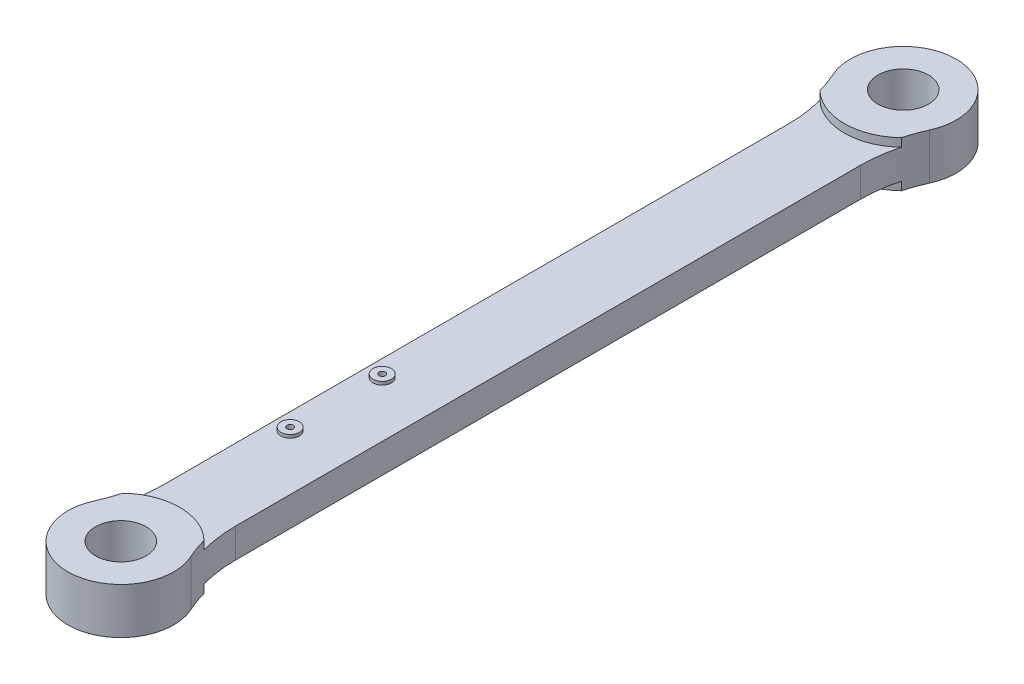
ISO-10303-21;
HEADER;
FILE_DESCRIPTION(('STEP AP214'),'2;1');
FILE_NAME('part.step','',(''),(''),'','','');
FILE_SCHEMA(('AUTOMOTIVE_DESIGN { 1 0 10303 214 1 1 1 1 }'));
ENDSEC;
DATA;
#1=APPLICATION_CONTEXT('core data for automotive mechanical design processes');
#2=APPLICATION_PROTOCOL_DEFINITION('international standard','automotive_design',2000,#1);
#3=PRODUCT_CONTEXT('',#1,'mechanical');
#4=PRODUCT('Part','Part','',(#3));
#5=PRODUCT_RELATED_PRODUCT_CATEGORY('part','',(#4));
#6=PRODUCT_DEFINITION_FORMATION('','',#4);
#7=PRODUCT_DEFINITION_CONTEXT('part definition',#1,'design');
#8=PRODUCT_DEFINITION('design','',#6,#7);
#9=PRODUCT_DEFINITION_SHAPE('','',#8);
#10=(LENGTH_UNIT() NAMED_UNIT(*) SI_UNIT(.MILLI.,.METRE.));
#11=(NAMED_UNIT(*) PLANE_ANGLE_UNIT() SI_UNIT($,.RADIAN.));
#12=(NAMED_UNIT(*) SI_UNIT($,.STERADIAN.) SOLID_ANGLE_UNIT());
#13=UNCERTAINTY_MEASURE_WITH_UNIT(LENGTH_MEASURE(1.E-05),#10,'distance_accuracy_value','');
#14=(GEOMETRIC_REPRESENTATION_CONTEXT(3) GLOBAL_UNCERTAINTY_ASSIGNED_CONTEXT((#13)) GLOBAL_UNIT_ASSIGNED_CONTEXT((#10,
#11,#12)) REPRESENTATION_CONTEXT('',''));
#15=CARTESIAN_POINT('',(0.,0.,0.));
#16=DIRECTION('',(0.,0.,1.));
#17=DIRECTION('',(1.,0.,0.));
#18=AXIS2_PLACEMENT_3D('',#15,#16,#17);
#19=CARTESIAN_POINT('',(0.,50.,0.));
#20=DIRECTION('',(0.,1.,0.));
#21=DIRECTION('',(0.,0.,1.));
#22=AXIS2_PLACEMENT_3D('',#19,#20,#21);
#23=PLANE('',#22);
#24=CARTESIAN_POINT('',(0.,50.,0.));
#25=DIRECTION('',(0.,1.,0.));
#26=DIRECTION('',(0.,0.,1.));
#27=AXIS2_PLACEMENT_3D('',#24,#25,#26);
#28=CIRCLE('',#27,115.);
#29=CARTESIAN_POINT('',(104.746987951807,50.,47.466498870508));
#30=VERTEX_POINT('',#29);
#31=CARTESIAN_POINT('',(-104.746987951807,50.,47.4664988705083));
#32=VERTEX_POINT('',#31);
#33=EDGE_CURVE('E247',#30,#32,#28,.T.);
#34=ORIENTED_EDGE('',*,*,#33,.T.);
#35=CARTESIAN_POINT('',(-378.,50.,171.292148097921));
#36=DIRECTION('',(0.,1.,0.));
#37=DIRECTION('',(0.,0.,1.));
#38=AXIS2_PLACEMENT_3D('',#35,#36,#37);
#39=CIRCLE('',#38,300.);
#40=CARTESIAN_POINT('',(-88.5520770167693,50.,92.4258062232414));
#41=VERTEX_POINT('',#40);
#42=EDGE_CURVE('E245',#32,#41,#39,.F.);
#43=ORIENTED_EDGE('',*,*,#42,.T.);
#44=CARTESIAN_POINT('',(0.,50.,0.));
#45=DIRECTION('',(0.,1.,0.));
#46=DIRECTION('',(0.,0.,1.));
#47=AXIS2_PLACEMENT_3D('',#44,#45,#46);
#48=CIRCLE('',#47,128.);
#49=CARTESIAN_POINT('',(88.5520770167693,50.,92.4258062232414));
#50=VERTEX_POINT('',#49);
#51=EDGE_CURVE('E240',#50,#41,#48,.F.);
#52=ORIENTED_EDGE('',*,*,#51,.F.);
#53=CARTESIAN_POINT('',(378.,50.,171.292148097921));
#54=DIRECTION('',(0.,1.,0.));
#55=DIRECTION('',(0.,0.,1.));
#56=AXIS2_PLACEMENT_3D('',#53,#54,#55);
#57=CIRCLE('',#56,300.);
#58=EDGE_CURVE('E243',#50,#30,#57,.F.);
#59=ORIENTED_EDGE('',*,*,#58,.T.);
#60=EDGE_LOOP('',(#34,#43,#52,#59));
#61=FACE_BOUND('',#60,.T.);
#62=CARTESIAN_POINT('',(0.,50.,0.));
#63=DIRECTION('',(0.,1.,0.));
#64=DIRECTION('',(0.,0.,1.));
#65=AXIS2_PLACEMENT_3D('',#62,#63,#64);
#66=CIRCLE('',#65,55.);
#67=CARTESIAN_POINT('',(0.,50.,55.));
#68=VERTEX_POINT('',#67);
#69=EDGE_CURVE('E187',#68,#68,#66,.T.);
#70=ORIENTED_EDGE('',*,*,#69,.F.);
#71=EDGE_LOOP('',(#70));
#72=FACE_BOUND('',#71,.T.);
#73=ADVANCED_FACE('F18',(#61,#72),#23,.T.);
#74=CARTESIAN_POINT('',(0.,-50.,0.));
#75=DIRECTION('',(0.,-1.,0.));
#76=DIRECTION('',(0.,0.,-1.));
#77=AXIS2_PLACEMENT_3D('',#74,#75,#76);
#78=PLANE('',#77);
#79=CARTESIAN_POINT('',(0.,-50.,0.));
#80=DIRECTION('',(0.,-1.,0.));
#81=DIRECTION('',(0.,0.,-1.));
#82=AXIS2_PLACEMENT_3D('',#79,#80,#81);
#83=CIRCLE('',#82,115.);
#84=CARTESIAN_POINT('',(-104.746987951807,-50.,47.4664988705082));
#85=VERTEX_POINT('',#84);
#86=CARTESIAN_POINT('',(104.746987951807,-50.,47.466498870508));
#87=VERTEX_POINT('',#86);
#88=EDGE_CURVE('E233',#85,#87,#83,.T.);
#89=ORIENTED_EDGE('',*,*,#88,.T.);
#90=CARTESIAN_POINT('',(378.,-50.,171.292148097921));
#91=DIRECTION('',(0.,-1.,0.));
#92=DIRECTION('',(0.,0.,-1.));
#93=AXIS2_PLACEMENT_3D('',#90,#91,#92);
#94=CIRCLE('',#93,300.);
#95=CARTESIAN_POINT('',(88.5520770167694,-50.,92.4258062232414));
#96=VERTEX_POINT('',#95);
#97=EDGE_CURVE('E33',#87,#96,#94,.F.);
#98=ORIENTED_EDGE('',*,*,#97,.T.);
#99=CARTESIAN_POINT('',(0.,-50.,0.));
#100=DIRECTION('',(0.,-1.,0.));
#101=DIRECTION('',(0.,0.,-1.));
#102=AXIS2_PLACEMENT_3D('',#99,#100,#101);
#103=CIRCLE('',#102,128.);
#104=CARTESIAN_POINT('',(-88.5520770167692,-50.,92.4258062232415));
#105=VERTEX_POINT('',#104);
#106=EDGE_CURVE('E228',#105,#96,#103,.F.);
#107=ORIENTED_EDGE('',*,*,#106,.F.);
#108=CARTESIAN_POINT('',(-378.,-50.,171.292148097921));
#109=DIRECTION('',(0.,-1.,0.));
#110=DIRECTION('',(0.,0.,-1.));
#111=AXIS2_PLACEMENT_3D('',#108,#109,#110);
#112=CIRCLE('',#111,300.);
#113=EDGE_CURVE('E231',#105,#85,#112,.F.);
#114=ORIENTED_EDGE('',*,*,#113,.T.);
#115=EDGE_LOOP('',(#89,#98,#107,#114));
#116=FACE_BOUND('',#115,.T.);
#117=CARTESIAN_POINT('',(0.,-50.,0.));
#118=DIRECTION('',(0.,-1.,0.));
#119=DIRECTION('',(0.,0.,-1.));
#120=AXIS2_PLACEMENT_3D('',#117,#118,#119);
#121=CIRCLE('',#120,55.);
#122=CARTESIAN_POINT('',(0.,-50.,-55.));
#123=VERTEX_POINT('',#122);
#124=EDGE_CURVE('E181',#123,#123,#121,.T.);
#125=ORIENTED_EDGE('',*,*,#124,.F.);
#126=EDGE_LOOP('',(#125));
#127=FACE_BOUND('',#126,.T.);
#128=ADVANCED_FACE('F153',(#116,#127),#78,.T.);
#129=CARTESIAN_POINT('',(0.,50.,1700.));
#130=DIRECTION('',(0.,1.,0.));
#131=DIRECTION('',(0.,0.,1.));
#132=AXIS2_PLACEMENT_3D('',#129,#130,#131);
#133=CIRCLE('',#132,115.);
#134=CARTESIAN_POINT('',(-104.746987951807,50.,1652.53350112949));
#135=VERTEX_POINT('',#134);
#136=CARTESIAN_POINT('',(104.746987951807,50.,1652.53350112949));
#137=VERTEX_POINT('',#136);
#138=EDGE_CURVE('E174',#135,#137,#133,.T.);
#139=ORIENTED_EDGE('',*,*,#138,.T.);
#140=CARTESIAN_POINT('',(378.,50.,1528.70785190208));
#141=DIRECTION('',(0.,1.,0.));
#142=DIRECTION('',(0.,0.,1.));
#143=AXIS2_PLACEMENT_3D('',#140,#141,#142);
#144=CIRCLE('',#143,300.);
#145=CARTESIAN_POINT('',(88.5520770167694,50.,1607.57419377676));
#146=VERTEX_POINT('',#145);
#147=EDGE_CURVE('E235',#137,#146,#144,.F.);
#148=ORIENTED_EDGE('',*,*,#147,.T.);
#149=CARTESIAN_POINT('',(0.,50.,1700.));
#150=DIRECTION('',(0.,1.,0.));
#151=DIRECTION('',(0.,0.,1.));
#152=AXIS2_PLACEMENT_3D('',#149,#150,#151);
#153=CIRCLE('',#152,128.);
#154=CARTESIAN_POINT('',(-88.5520770167694,50.,1607.57419377676));
#155=VERTEX_POINT('',#154);
#156=EDGE_CURVE('E26',#146,#155,#153,.T.);
#157=ORIENTED_EDGE('',*,*,#156,.T.);
#158=CARTESIAN_POINT('',(-378.,50.,1528.70785190208));
#159=DIRECTION('',(0.,1.,0.));
#160=DIRECTION('',(0.,0.,1.));
#161=AXIS2_PLACEMENT_3D('',#158,#159,#160);
#162=CIRCLE('',#161,300.);
#163=EDGE_CURVE('E237',#155,#135,#162,.F.);
#164=ORIENTED_EDGE('',*,*,#163,.T.);
#165=EDGE_LOOP('',(#139,#148,#157,#164));
#166=FACE_BOUND('',#165,.T.);
#167=CARTESIAN_POINT('',(0.,50.,1700.));
#168=DIRECTION('',(0.,1.,0.));
#169=DIRECTION('',(0.,0.,1.));
#170=AXIS2_PLACEMENT_3D('',#167,#168,#169);
#171=CIRCLE('',#170,55.);
#172=CARTESIAN_POINT('',(0.,50.,1755.));
#173=VERTEX_POINT('',#172);
#174=EDGE_CURVE('E178',#173,#173,#171,.T.);
#175=ORIENTED_EDGE('',*,*,#174,.F.);
#176=EDGE_LOOP('',(#175));
#177=FACE_BOUND('',#176,.T.);
#178=ADVANCED_FACE('F156',(#166,#177),#23,.T.);
#179=CARTESIAN_POINT('',(0.,-50.,1700.));
#180=DIRECTION('',(0.,-1.,0.));
#181=DIRECTION('',(0.,0.,-1.));
#182=AXIS2_PLACEMENT_3D('',#179,#180,#181);
#183=CIRCLE('',#182,115.);
#184=CARTESIAN_POINT('',(104.746987951807,-50.,1652.53350112949));
#185=VERTEX_POINT('',#184);
#186=CARTESIAN_POINT('',(-104.746987951807,-50.,1652.53350112949));
#187=VERTEX_POINT('',#186);
#188=EDGE_CURVE('E226',#185,#187,#183,.T.);
#189=ORIENTED_EDGE('',*,*,#188,.T.);
#190=CARTESIAN_POINT('',(-378.,-50.,1528.70785190208));
#191=DIRECTION('',(0.,-1.,0.));
#192=DIRECTION('',(0.,0.,-1.));
#193=AXIS2_PLACEMENT_3D('',#190,#191,#192);
#194=CIRCLE('',#193,300.);
#195=CARTESIAN_POINT('',(-88.5520770167694,-50.,1607.57419377676));
#196=VERTEX_POINT('',#195);
#197=EDGE_CURVE('E40',#187,#196,#194,.F.);
#198=ORIENTED_EDGE('',*,*,#197,.T.);
#199=CARTESIAN_POINT('',(0.,-50.,1700.));
#200=DIRECTION('',(0.,-1.,0.));
#201=DIRECTION('',(0.,0.,-1.));
#202=AXIS2_PLACEMENT_3D('',#199,#200,#201);
#203=CIRCLE('',#202,128.);
#204=CARTESIAN_POINT('',(88.5520770167694,-50.,1607.57419377676));
#205=VERTEX_POINT('',#204);
#206=EDGE_CURVE('E11',#196,#205,#203,.T.);
#207=ORIENTED_EDGE('',*,*,#206,.T.);
#208=CARTESIAN_POINT('',(378.,-50.,1528.70785190208));
#209=DIRECTION('',(0.,-1.,0.));
#210=DIRECTION('',(0.,0.,-1.));
#211=AXIS2_PLACEMENT_3D('',#208,#209,#210);
#212=CIRCLE('',#211,300.);
#213=EDGE_CURVE('E220',#205,#185,#212,.F.);
#214=ORIENTED_EDGE('',*,*,#213,.T.);
#215=EDGE_LOOP('',(#189,#198,#207,#214));
#216=FACE_BOUND('',#215,.T.);
#217=CARTESIAN_POINT('',(0.,-50.,1700.));
#218=DIRECTION('',(0.,-1.,0.));
#219=DIRECTION('',(0.,0.,-1.));
#220=AXIS2_PLACEMENT_3D('',#217,#218,#219);
#221=CIRCLE('',#220,55.);
#222=CARTESIAN_POINT('',(0.,-50.,1645.));
#223=VERTEX_POINT('',#222);
#224=EDGE_CURVE('E180',#223,#223,#221,.T.);
#225=ORIENTED_EDGE('',*,*,#224,.F.);
#226=EDGE_LOOP('',(#225));
#227=FACE_BOUND('',#226,.T.);
#228=ADVANCED_FACE('F161',(#216,#227),#78,.T.);
#229=CARTESIAN_POINT('',(0.,-32.,0.));
#230=DIRECTION('',(0.,1.,0.));
#231=DIRECTION('',(0.,0.,1.));
#232=AXIS2_PLACEMENT_3D('',#229,#230,#231);
#233=CYLINDRICAL_SURFACE('',#232,115.);
#234=ORIENTED_EDGE('',*,*,#88,.F.);
#235=DIRECTION('',(0.,1.,0.));
#236=VECTOR('',#235,1.);
#237=CARTESIAN_POINT('',(-104.746987951807,-32.,47.4664988705083));
#238=LINE('',#237,#236);
#239=EDGE_CURVE('E299',#85,#32,#238,.T.);
#240=ORIENTED_EDGE('',*,*,#239,.T.);
#241=ORIENTED_EDGE('',*,*,#33,.F.);
#242=DIRECTION('',(0.,1.,0.));
#243=VECTOR('',#242,1.);
#244=CARTESIAN_POINT('',(104.746987951807,-32.,47.4664988705081));
#245=LINE('',#244,#243);
#246=EDGE_CURVE('E308',#30,#87,#245,.F.);
#247=ORIENTED_EDGE('',*,*,#246,.T.);
#248=EDGE_LOOP('',(#234,#240,#241,#247));
#249=FACE_BOUND('',#248,.T.);
#250=ADVANCED_FACE('F170',(#249),#233,.T.);
#251=CARTESIAN_POINT('',(0.,-32.,1700.));
#252=DIRECTION('',(0.,1.,0.));
#253=DIRECTION('',(0.,0.,1.));
#254=AXIS2_PLACEMENT_3D('',#251,#252,#253);
#255=CYLINDRICAL_SURFACE('',#254,115.);
#256=ORIENTED_EDGE('',*,*,#188,.F.);
#257=DIRECTION('',(0.,1.,0.));
#258=VECTOR('',#257,1.);
#259=CARTESIAN_POINT('',(104.746987951807,-32.,1652.53350112949));
#260=LINE('',#259,#258);
#261=EDGE_CURVE('E341',#185,#137,#260,.T.);
#262=ORIENTED_EDGE('',*,*,#261,.T.);
#263=ORIENTED_EDGE('',*,*,#138,.F.);
#264=DIRECTION('',(0.,1.,0.));
#265=VECTOR('',#264,1.);
#266=CARTESIAN_POINT('',(-104.746987951807,-32.,1652.53350112949));
#267=LINE('',#266,#265);
#268=EDGE_CURVE('E326',#135,#187,#267,.F.);
#269=ORIENTED_EDGE('',*,*,#268,.T.);
#270=EDGE_LOOP('',(#256,#262,#263,#269));
#271=FACE_BOUND('',#270,.T.);
#272=ADVANCED_FACE('F410',(#271),#255,.T.);
#273=CARTESIAN_POINT('',(-378.,-32.,171.292148097921));
#274=DIRECTION('',(0.,1.,0.));
#275=DIRECTION('',(0.,0.,1.));
#276=AXIS2_PLACEMENT_3D('',#273,#274,#275);
#277=CYLINDRICAL_SURFACE('',#276,300.);
#278=ORIENTED_EDGE('',*,*,#113,.F.);
#279=DIRECTION('',(0.,1.,0.));
#280=VECTOR('',#279,1.);
#281=CARTESIAN_POINT('',(-88.5520770167693,-1978.76654994891,92.4258062232415));
#282=LINE('',#281,#280);
#283=CARTESIAN_POINT('',(-88.5520770167692,-32.,92.4258062232415));
#284=VERTEX_POINT('',#283);
#285=EDGE_CURVE('E259',#105,#284,#282,.T.);
#286=ORIENTED_EDGE('',*,*,#285,.T.);
#287=CARTESIAN_POINT('',(-378.,-32.,171.292148097921));
#288=DIRECTION('',(0.,-1.,0.));
#289=DIRECTION('',(0.,0.,-1.));
#290=AXIS2_PLACEMENT_3D('',#287,#288,#289);
#291=CIRCLE('',#290,300.);
#292=CARTESIAN_POINT('',(-78.,-32.,171.292148097921));
#293=VERTEX_POINT('',#292);
#294=EDGE_CURVE('E288',#293,#284,#291,.F.);
#295=ORIENTED_EDGE('',*,*,#294,.F.);
#296=DIRECTION('',(0.,-1.,0.));
#297=VECTOR('',#296,1.);
#298=CARTESIAN_POINT('',(-78.,-32.,171.292148097921));
#299=LINE('',#298,#297);
#300=CARTESIAN_POINT('',(-78.,32.,171.292148097921));
#301=VERTEX_POINT('',#300);
#302=EDGE_CURVE('E367',#301,#293,#299,.T.);
#303=ORIENTED_EDGE('',*,*,#302,.F.);
#304=CARTESIAN_POINT('',(-378.,32.,171.292148097921));
#305=DIRECTION('',(0.,-1.,0.));
#306=DIRECTION('',(0.,0.,-1.));
#307=AXIS2_PLACEMENT_3D('',#304,#305,#306);
#308=CIRCLE('',#307,300.);
#309=CARTESIAN_POINT('',(-88.5520770167693,32.,92.4258062232413));
#310=VERTEX_POINT('',#309);
#311=EDGE_CURVE('E371',#310,#301,#308,.T.);
#312=ORIENTED_EDGE('',*,*,#311,.F.);
#313=DIRECTION('',(0.,-1.,0.));
#314=VECTOR('',#313,1.);
#315=CARTESIAN_POINT('',(-88.5520770167693,1978.76654994891,92.4258062232414));
#316=LINE('',#315,#314);
#317=EDGE_CURVE('E273',#41,#310,#316,.T.);
#318=ORIENTED_EDGE('',*,*,#317,.F.);
#319=ORIENTED_EDGE('',*,*,#42,.F.);
#320=ORIENTED_EDGE('',*,*,#239,.F.);
#321=EDGE_LOOP('',(#278,#286,#295,#303,#312,#318,#319,#320));
#322=FACE_BOUND('',#321,.T.);
#323=ADVANCED_FACE('F373',(#322),#277,.F.);
#324=CARTESIAN_POINT('',(-378.,-32.,1528.70785190208));
#325=DIRECTION('',(0.,1.,0.));
#326=DIRECTION('',(0.,0.,1.));
#327=AXIS2_PLACEMENT_3D('',#324,#325,#326);
#328=CYLINDRICAL_SURFACE('',#327,300.);
#329=ORIENTED_EDGE('',*,*,#197,.F.);
#330=ORIENTED_EDGE('',*,*,#268,.F.);
#331=ORIENTED_EDGE('',*,*,#163,.F.);
#332=DIRECTION('',(0.,-1.,0.));
#333=VECTOR('',#332,1.);
#334=CARTESIAN_POINT('',(-88.5520770167693,1978.76654994891,1607.57419377676));
#335=LINE('',#334,#333);
#336=CARTESIAN_POINT('',(-88.5520770167694,32.,1607.57419377676));
#337=VERTEX_POINT('',#336);
#338=EDGE_CURVE('E266',#155,#337,#335,.T.);
#339=ORIENTED_EDGE('',*,*,#338,.T.);
#340=CARTESIAN_POINT('',(-378.,32.,1528.70785190208));
#341=DIRECTION('',(0.,-1.,0.));
#342=DIRECTION('',(0.,0.,-1.));
#343=AXIS2_PLACEMENT_3D('',#340,#341,#342);
#344=CIRCLE('',#343,300.);
#345=CARTESIAN_POINT('',(-78.,32.,1528.70785190208));
#346=VERTEX_POINT('',#345);
#347=EDGE_CURVE('E336',#346,#337,#344,.T.);
#348=ORIENTED_EDGE('',*,*,#347,.F.);
#349=DIRECTION('',(0.,-1.,0.));
#350=VECTOR('',#349,1.);
#351=CARTESIAN_POINT('',(-78.,32.,1528.70785190208));
#352=LINE('',#351,#350);
#353=CARTESIAN_POINT('',(-78.,-32.,1528.70785190208));
#354=VERTEX_POINT('',#353);
#355=EDGE_CURVE('E293',#354,#346,#352,.F.);
#356=ORIENTED_EDGE('',*,*,#355,.F.);
#357=CARTESIAN_POINT('',(-378.,-32.,1528.70785190208));
#358=DIRECTION('',(0.,-1.,0.));
#359=DIRECTION('',(0.,0.,-1.));
#360=AXIS2_PLACEMENT_3D('',#357,#358,#359);
#361=CIRCLE('',#360,300.);
#362=CARTESIAN_POINT('',(-88.5520770167695,-32.,1607.57419377676));
#363=VERTEX_POINT('',#362);
#364=EDGE_CURVE('E339',#363,#354,#361,.F.);
#365=ORIENTED_EDGE('',*,*,#364,.F.);
#366=DIRECTION('',(0.,1.,0.));
#367=VECTOR('',#366,1.);
#368=CARTESIAN_POINT('',(-88.5520770167694,-1978.76654994891,1607.57419377676));
#369=LINE('',#368,#367);
#370=EDGE_CURVE('E252',#196,#363,#369,.T.);
#371=ORIENTED_EDGE('',*,*,#370,.F.);
#372=EDGE_LOOP('',(#329,#330,#331,#339,#348,#356,#365,#371));
#373=FACE_BOUND('',#372,.T.);
#374=ADVANCED_FACE('F323',(#373),#328,.F.);
#375=CARTESIAN_POINT('',(378.,-32.,1528.70785190208));
#376=DIRECTION('',(0.,1.,0.));
#377=DIRECTION('',(0.,0.,1.));
#378=AXIS2_PLACEMENT_3D('',#375,#376,#377);
#379=CYLINDRICAL_SURFACE('',#378,300.);
#380=ORIENTED_EDGE('',*,*,#213,.F.);
#381=DIRECTION('',(0.,1.,0.));
#382=VECTOR('',#381,1.);
#383=CARTESIAN_POINT('',(88.5520770167694,-1978.76654994891,1607.57419377676));
#384=LINE('',#383,#382);
#385=CARTESIAN_POINT('',(88.5520770167695,-32.,1607.57419377676));
#386=VERTEX_POINT('',#385);
#387=EDGE_CURVE('E254',#205,#386,#384,.T.);
#388=ORIENTED_EDGE('',*,*,#387,.T.);
#389=CARTESIAN_POINT('',(378.,-32.,1528.70785190208));
#390=DIRECTION('',(0.,-1.,0.));
#391=DIRECTION('',(0.,0.,-1.));
#392=AXIS2_PLACEMENT_3D('',#389,#390,#391);
#393=CIRCLE('',#392,300.);
#394=CARTESIAN_POINT('',(78.,-32.,1528.70785190208));
#395=VERTEX_POINT('',#394);
#396=EDGE_CURVE('E309',#395,#386,#393,.F.);
#397=ORIENTED_EDGE('',*,*,#396,.F.);
#398=DIRECTION('',(0.,-1.,0.));
#399=VECTOR('',#398,1.);
#400=CARTESIAN_POINT('',(78.,-32.,1528.70785190208));
#401=LINE('',#400,#399);
#402=CARTESIAN_POINT('',(78.,32.,1528.70785190208));
#403=VERTEX_POINT('',#402);
#404=EDGE_CURVE('E345',#403,#395,#401,.T.);
#405=ORIENTED_EDGE('',*,*,#404,.F.);
#406=CARTESIAN_POINT('',(378.,32.,1528.70785190208));
#407=DIRECTION('',(0.,-1.,0.));
#408=DIRECTION('',(0.,0.,-1.));
#409=AXIS2_PLACEMENT_3D('',#406,#407,#408);
#410=CIRCLE('',#409,300.);
#411=CARTESIAN_POINT('',(88.5520770167694,32.,1607.57419377676));
#412=VERTEX_POINT('',#411);
#413=EDGE_CURVE('E333',#412,#403,#410,.T.);
#414=ORIENTED_EDGE('',*,*,#413,.F.);
#415=DIRECTION('',(0.,-1.,0.));
#416=VECTOR('',#415,1.);
#417=CARTESIAN_POINT('',(88.5520770167694,1978.76654994891,1607.57419377676));
#418=LINE('',#417,#416);
#419=EDGE_CURVE('E268',#146,#412,#418,.T.);
#420=ORIENTED_EDGE('',*,*,#419,.F.);
#421=ORIENTED_EDGE('',*,*,#147,.F.);
#422=ORIENTED_EDGE('',*,*,#261,.F.);
#423=EDGE_LOOP('',(#380,#388,#397,#405,#414,#420,#421,#422));
#424=FACE_BOUND('',#423,.T.);
#425=ADVANCED_FACE('F406',(#424),#379,.F.);
#426=CARTESIAN_POINT('',(378.,-32.,171.292148097921));
#427=DIRECTION('',(0.,1.,0.));
#428=DIRECTION('',(0.,0.,1.));
#429=AXIS2_PLACEMENT_3D('',#426,#427,#428);
#430=CYLINDRICAL_SURFACE('',#429,300.);
#431=ORIENTED_EDGE('',*,*,#97,.F.);
#432=ORIENTED_EDGE('',*,*,#246,.F.);
#433=ORIENTED_EDGE('',*,*,#58,.F.);
#434=DIRECTION('',(0.,-1.,0.));
#435=VECTOR('',#434,1.);
#436=CARTESIAN_POINT('',(88.5520770167693,1978.76654994891,92.4258062232414));
#437=LINE('',#436,#435);
#438=CARTESIAN_POINT('',(88.5520770167694,32.,92.4258062232414));
#439=VERTEX_POINT('',#438);
#440=EDGE_CURVE('E275',#50,#439,#437,.T.);
#441=ORIENTED_EDGE('',*,*,#440,.T.);
#442=CARTESIAN_POINT('',(378.,32.,171.292148097921));
#443=DIRECTION('',(0.,-1.,0.));
#444=DIRECTION('',(0.,0.,-1.));
#445=AXIS2_PLACEMENT_3D('',#442,#443,#444);
#446=CIRCLE('',#445,300.);
#447=CARTESIAN_POINT('',(78.,32.,171.292148097921));
#448=VERTEX_POINT('',#447);
#449=EDGE_CURVE('E312',#448,#439,#446,.T.);
#450=ORIENTED_EDGE('',*,*,#449,.F.);
#451=DIRECTION('',(0.,-1.,0.));
#452=VECTOR('',#451,1.);
#453=CARTESIAN_POINT('',(78.,32.,171.292148097921));
#454=LINE('',#453,#452);
#455=CARTESIAN_POINT('',(78.,-32.,171.292148097921));
#456=VERTEX_POINT('',#455);
#457=EDGE_CURVE('E305',#456,#448,#454,.F.);
#458=ORIENTED_EDGE('',*,*,#457,.F.);
#459=CARTESIAN_POINT('',(378.,-32.,171.292148097921));
#460=DIRECTION('',(0.,-1.,0.));
#461=DIRECTION('',(0.,0.,-1.));
#462=AXIS2_PLACEMENT_3D('',#459,#460,#461);
#463=CIRCLE('',#462,300.);
#464=CARTESIAN_POINT('',(88.5520770167694,-32.0000000000005,92.4258062232414));
#465=VERTEX_POINT('',#464);
#466=EDGE_CURVE('E315',#465,#456,#463,.F.);
#467=ORIENTED_EDGE('',*,*,#466,.F.);
#468=DIRECTION('',(0.,1.,0.));
#469=VECTOR('',#468,1.);
#470=CARTESIAN_POINT('',(88.5520770167694,-1978.76654994891,92.4258062232414));
#471=LINE('',#470,#469);
#472=EDGE_CURVE('E261',#96,#465,#471,.T.);
#473=ORIENTED_EDGE('',*,*,#472,.F.);
#474=EDGE_LOOP('',(#431,#432,#433,#441,#450,#458,#467,#473));
#475=FACE_BOUND('',#474,.T.);
#476=ADVANCED_FACE('F20',(#475),#430,.F.);
#477=CARTESIAN_POINT('',(0.,-1978.76654994891,0.));
#478=DIRECTION('',(0.,1.,0.));
#479=DIRECTION('',(0.,0.,1.));
#480=AXIS2_PLACEMENT_3D('',#477,#478,#479);
#481=CYLINDRICAL_SURFACE('',#480,128.);
#482=ORIENTED_EDGE('',*,*,#285,.F.);
#483=ORIENTED_EDGE('',*,*,#106,.T.);
#484=ORIENTED_EDGE('',*,*,#472,.T.);
#485=CARTESIAN_POINT('',(0.,-32.,0.));
#486=DIRECTION('',(0.,-1.,0.));
#487=DIRECTION('',(0.,0.,-1.));
#488=AXIS2_PLACEMENT_3D('',#485,#486,#487);
#489=CIRCLE('',#488,128.);
#490=EDGE_CURVE('E256',#284,#465,#489,.F.);
#491=ORIENTED_EDGE('',*,*,#490,.F.);
#492=EDGE_LOOP('',(#482,#483,#484,#491));
#493=FACE_BOUND('',#492,.T.);
#494=ADVANCED_FACE('F391',(#493),#481,.T.);
#495=CARTESIAN_POINT('',(0.,-1978.76654994891,1700.));
#496=DIRECTION('',(0.,1.,0.));
#497=DIRECTION('',(0.,0.,1.));
#498=AXIS2_PLACEMENT_3D('',#495,#496,#497);
#499=CYLINDRICAL_SURFACE('',#498,128.);
#500=ORIENTED_EDGE('',*,*,#206,.F.);
#501=ORIENTED_EDGE('',*,*,#370,.T.);
#502=CARTESIAN_POINT('',(0.,-32.,1700.));
#503=DIRECTION('',(0.,-1.,0.));
#504=DIRECTION('',(0.,0.,-1.));
#505=AXIS2_PLACEMENT_3D('',#502,#503,#504);
#506=CIRCLE('',#505,128.);
#507=EDGE_CURVE('E249',#363,#386,#506,.T.);
#508=ORIENTED_EDGE('',*,*,#507,.T.);
#509=ORIENTED_EDGE('',*,*,#387,.F.);
#510=EDGE_LOOP('',(#500,#501,#508,#509));
#511=FACE_BOUND('',#510,.T.);
#512=ADVANCED_FACE('F359',(#511),#499,.T.);
#513=CARTESIAN_POINT('',(0.,1978.76654994891,0.));
#514=DIRECTION('',(0.,-1.,0.));
#515=DIRECTION('',(0.,0.,-1.));
#516=AXIS2_PLACEMENT_3D('',#513,#514,#515);
#517=CYLINDRICAL_SURFACE('',#516,128.);
#518=ORIENTED_EDGE('',*,*,#440,.F.);
#519=ORIENTED_EDGE('',*,*,#51,.T.);
#520=ORIENTED_EDGE('',*,*,#317,.T.);
#521=CARTESIAN_POINT('',(0.,32.,0.));
#522=DIRECTION('',(0.,1.,0.));
#523=DIRECTION('',(0.,0.,1.));
#524=AXIS2_PLACEMENT_3D('',#521,#522,#523);
#525=CIRCLE('',#524,128.);
#526=EDGE_CURVE('E270',#439,#310,#525,.F.);
#527=ORIENTED_EDGE('',*,*,#526,.F.);
#528=EDGE_LOOP('',(#518,#519,#520,#527));
#529=FACE_BOUND('',#528,.T.);
#530=ADVANCED_FACE('F382',(#529),#517,.T.);
#531=CARTESIAN_POINT('',(0.,1978.76654994891,1700.));
#532=DIRECTION('',(0.,-1.,0.));
#533=DIRECTION('',(0.,0.,-1.));
#534=AXIS2_PLACEMENT_3D('',#531,#532,#533);
#535=CYLINDRICAL_SURFACE('',#534,128.);
#536=ORIENTED_EDGE('',*,*,#156,.F.);
#537=ORIENTED_EDGE('',*,*,#419,.T.);
#538=CARTESIAN_POINT('',(0.,32.,1700.));
#539=DIRECTION('',(0.,1.,0.));
#540=DIRECTION('',(0.,0.,1.));
#541=AXIS2_PLACEMENT_3D('',#538,#539,#540);
#542=CIRCLE('',#541,128.);
#543=EDGE_CURVE('E263',#412,#337,#542,.T.);
#544=ORIENTED_EDGE('',*,*,#543,.T.);
#545=ORIENTED_EDGE('',*,*,#338,.F.);
#546=EDGE_LOOP('',(#536,#537,#544,#545));
#547=FACE_BOUND('',#546,.T.);
#548=ADVANCED_FACE('F327',(#547),#535,.T.);
#549=CARTESIAN_POINT('',(0.,-32.,1700.));
#550=DIRECTION('',(0.,-1.,0.));
#551=DIRECTION('',(0.,0.,-1.));
#552=AXIS2_PLACEMENT_3D('',#549,#550,#551);
#553=PLANE('',#552);
#554=ORIENTED_EDGE('',*,*,#396,.T.);
#555=ORIENTED_EDGE('',*,*,#507,.F.);
#556=ORIENTED_EDGE('',*,*,#364,.T.);
#557=DIRECTION('',(0.,0.,-1.));
#558=VECTOR('',#557,1.);
#559=CARTESIAN_POINT('',(-78.,-32.,1615.49556224671));
#560=LINE('',#559,#558);
#561=EDGE_CURVE('E290',#354,#293,#560,.T.);
#562=ORIENTED_EDGE('',*,*,#561,.T.);
#563=ORIENTED_EDGE('',*,*,#294,.T.);
#564=ORIENTED_EDGE('',*,*,#490,.T.);
#565=ORIENTED_EDGE('',*,*,#466,.T.);
#566=DIRECTION('',(0.,0.,1.));
#567=VECTOR('',#566,1.);
#568=CARTESIAN_POINT('',(78.,-32.,84.504437753292));
#569=LINE('',#568,#567);
#570=EDGE_CURVE('E292',#456,#395,#569,.T.);
#571=ORIENTED_EDGE('',*,*,#570,.T.);
#572=EDGE_LOOP('',(#554,#555,#556,#562,#563,#564,#565,#571));
#573=FACE_BOUND('',#572,.T.);
#574=ADVANCED_FACE('F352',(#573),#553,.T.);
#575=CARTESIAN_POINT('',(0.,32.,1700.));
#576=DIRECTION('',(0.,-1.,0.));
#577=DIRECTION('',(0.,0.,-1.));
#578=AXIS2_PLACEMENT_3D('',#575,#576,#577);
#579=PLANE('',#578);
#580=CARTESIAN_POINT('',(-42.,32.,1090.));
#581=DIRECTION('',(0.,-1.,0.));
#582=DIRECTION('',(0.,0.,1.));
#583=AXIS2_PLACEMENT_3D('',#580,#581,#582);
#584=CIRCLE('',#583,20.);
#585=CARTESIAN_POINT('',(-42.,32.,1110.));
#586=VERTEX_POINT('',#585);
#587=EDGE_CURVE('E209',#586,#586,#584,.T.);
#588=ORIENTED_EDGE('',*,*,#587,.T.);
#589=EDGE_LOOP('',(#588));
#590=FACE_BOUND('',#589,.T.);
#591=CARTESIAN_POINT('',(-42.,32.,1290.));
#592=DIRECTION('',(0.,-1.,0.));
#593=DIRECTION('',(0.,0.,1.));
#594=AXIS2_PLACEMENT_3D('',#591,#592,#593);
#595=CIRCLE('',#594,20.);
#596=CARTESIAN_POINT('',(-42.,32.,1310.));
#597=VERTEX_POINT('',#596);
#598=EDGE_CURVE('E213',#597,#597,#595,.T.);
#599=ORIENTED_EDGE('',*,*,#598,.T.);
#600=EDGE_LOOP('',(#599));
#601=FACE_BOUND('',#600,.T.);
#602=ORIENTED_EDGE('',*,*,#543,.F.);
#603=ORIENTED_EDGE('',*,*,#413,.T.);
#604=DIRECTION('',(0.,0.,1.));
#605=VECTOR('',#604,1.);
#606=CARTESIAN_POINT('',(78.,32.,84.504437753292));
#607=LINE('',#606,#605);
#608=EDGE_CURVE('E287',#448,#403,#607,.T.);
#609=ORIENTED_EDGE('',*,*,#608,.F.);
#610=ORIENTED_EDGE('',*,*,#449,.T.);
#611=ORIENTED_EDGE('',*,*,#526,.T.);
#612=ORIENTED_EDGE('',*,*,#311,.T.);
#613=DIRECTION('',(0.,0.,-1.));
#614=VECTOR('',#613,1.);
#615=CARTESIAN_POINT('',(-78.,32.,1615.49556224671));
#616=LINE('',#615,#614);
#617=EDGE_CURVE('E277',#346,#301,#616,.T.);
#618=ORIENTED_EDGE('',*,*,#617,.F.);
#619=ORIENTED_EDGE('',*,*,#347,.T.);
#620=EDGE_LOOP('',(#602,#603,#609,#610,#611,#612,#618,#619));
#621=FACE_BOUND('',#620,.T.);
#622=ADVANCED_FACE('F331',(#590,#601,#621),#579,.F.);
#623=CARTESIAN_POINT('',(-78.,-32.,1615.49556224671));
#624=DIRECTION('',(1.,0.,0.));
#625=DIRECTION('',(0.,0.,-1.));
#626=AXIS2_PLACEMENT_3D('',#623,#624,#625);
#627=PLANE('',#626);
#628=CARTESIAN_POINT('',(-78.,0.,850.));
#629=DIRECTION('',(1.,0.,0.));
#630=DIRECTION('',(0.,0.,1.));
#631=AXIS2_PLACEMENT_3D('',#628,#629,#630);
#632=CIRCLE('',#631,20.);
#633=CARTESIAN_POINT('',(-78.,0.,870.));
#634=VERTEX_POINT('',#633);
#635=EDGE_CURVE('E184',#634,#634,#632,.T.);
#636=ORIENTED_EDGE('',*,*,#635,.T.);
#637=EDGE_LOOP('',(#636));
#638=FACE_BOUND('',#637,.T.);
#639=ORIENTED_EDGE('',*,*,#561,.F.);
#640=ORIENTED_EDGE('',*,*,#355,.T.);
#641=ORIENTED_EDGE('',*,*,#617,.T.);
#642=ORIENTED_EDGE('',*,*,#302,.T.);
#643=EDGE_LOOP('',(#639,#640,#641,#642));
#644=FACE_BOUND('',#643,.T.);
#645=ADVANCED_FACE('F365',(#638,#644),#627,.F.);
#646=CARTESIAN_POINT('',(78.,-32.,84.504437753292));
#647=DIRECTION('',(-1.,0.,0.));
#648=DIRECTION('',(0.,0.,1.));
#649=AXIS2_PLACEMENT_3D('',#646,#647,#648);
#650=PLANE('',#649);
#651=ORIENTED_EDGE('',*,*,#570,.F.);
#652=ORIENTED_EDGE('',*,*,#457,.T.);
#653=ORIENTED_EDGE('',*,*,#608,.T.);
#654=ORIENTED_EDGE('',*,*,#404,.T.);
#655=EDGE_LOOP('',(#651,#652,#653,#654));
#656=FACE_BOUND('',#655,.T.);
#657=ADVANCED_FACE('F395',(#656),#650,.F.);
#658=CARTESIAN_POINT('',(-42.,39.,1290.));
#659=DIRECTION('',(0.,-1.,0.));
#660=DIRECTION('',(0.,0.,-1.));
#661=AXIS2_PLACEMENT_3D('',#658,#659,#660);
#662=CYLINDRICAL_SURFACE('',#661,20.);
#663=CARTESIAN_POINT('',(-42.,39.,1290.));
#664=DIRECTION('',(0.,-1.,0.));
#665=DIRECTION('',(0.,0.,1.));
#666=AXIS2_PLACEMENT_3D('',#663,#664,#665);
#667=CIRCLE('',#666,20.);
#668=CARTESIAN_POINT('',(-42.,39.,1310.));
#669=VERTEX_POINT('',#668);
#670=EDGE_CURVE('E217',#669,#669,#667,.T.);
#671=ORIENTED_EDGE('',*,*,#670,.T.);
#672=EDGE_LOOP('',(#671));
#673=FACE_BOUND('',#672,.T.);
#674=ORIENTED_EDGE('',*,*,#598,.F.);
#675=EDGE_LOOP('',(#674));
#676=FACE_BOUND('',#675,.T.);
#677=ADVANCED_FACE('F438',(#673,#676),#662,.T.);
#678=CARTESIAN_POINT('',(-42.,39.,1290.));
#679=DIRECTION('',(0.,-1.,0.));
#680=DIRECTION('',(0.,0.,-1.));
#681=AXIS2_PLACEMENT_3D('',#678,#679,#680);
#682=PLANE('',#681);
#683=CARTESIAN_POINT('',(-42.,39.,1290.));
#684=DIRECTION('',(0.,-1.,0.));
#685=DIRECTION('',(0.,0.,1.));
#686=AXIS2_PLACEMENT_3D('',#683,#684,#685);
#687=CIRCLE('',#686,6.9175);
#688=CARTESIAN_POINT('',(-42.,39.,1296.9175));
#689=VERTEX_POINT('',#688);
#690=EDGE_CURVE('E200',#689,#689,#687,.T.);
#691=ORIENTED_EDGE('',*,*,#690,.T.);
#692=EDGE_LOOP('',(#691));
#693=FACE_BOUND('',#692,.T.);
#694=ORIENTED_EDGE('',*,*,#670,.F.);
#695=EDGE_LOOP('',(#694));
#696=FACE_BOUND('',#695,.T.);
#697=ADVANCED_FACE('F509',(#693,#696),#682,.F.);
#698=CARTESIAN_POINT('',(-42.,39.,1090.));
#699=DIRECTION('',(0.,-1.,0.));
#700=DIRECTION('',(0.,0.,-1.));
#701=AXIS2_PLACEMENT_3D('',#698,#699,#700);
#702=CYLINDRICAL_SURFACE('',#701,20.);
#703=CARTESIAN_POINT('',(-42.,39.,1090.));
#704=DIRECTION('',(0.,-1.,0.));
#705=DIRECTION('',(0.,0.,1.));
#706=AXIS2_PLACEMENT_3D('',#703,#704,#705);
#707=CIRCLE('',#706,20.);
#708=CARTESIAN_POINT('',(-42.,39.,1110.));
#709=VERTEX_POINT('',#708);
#710=EDGE_CURVE('E210',#709,#709,#707,.T.);
#711=ORIENTED_EDGE('',*,*,#710,.T.);
#712=EDGE_LOOP('',(#711));
#713=FACE_BOUND('',#712,.T.);
#714=ORIENTED_EDGE('',*,*,#587,.F.);
#715=EDGE_LOOP('',(#714));
#716=FACE_BOUND('',#715,.T.);
#717=ADVANCED_FACE('F521',(#713,#716),#702,.T.);
#718=CARTESIAN_POINT('',(-42.,39.,1090.));
#719=DIRECTION('',(0.,-1.,0.));
#720=DIRECTION('',(0.,0.,-1.));
#721=AXIS2_PLACEMENT_3D('',#718,#719,#720);
#722=PLANE('',#721);
#723=CARTESIAN_POINT('',(-42.,39.,1090.));
#724=DIRECTION('',(0.,-1.,0.));
#725=DIRECTION('',(0.,0.,1.));
#726=AXIS2_PLACEMENT_3D('',#723,#724,#725);
#727=CIRCLE('',#726,6.9175);
#728=CARTESIAN_POINT('',(-42.,39.,1096.9175));
#729=VERTEX_POINT('',#728);
#730=EDGE_CURVE('E206',#729,#729,#727,.T.);
#731=ORIENTED_EDGE('',*,*,#730,.T.);
#732=EDGE_LOOP('',(#731));
#733=FACE_BOUND('',#732,.T.);
#734=ORIENTED_EDGE('',*,*,#710,.F.);
#735=EDGE_LOOP('',(#734));
#736=FACE_BOUND('',#735,.T.);
#737=ADVANCED_FACE('F532',(#733,#736),#722,.F.);
#738=CARTESIAN_POINT('',(-42.,39.,1090.));
#739=DIRECTION('',(0.,-1.,0.));
#740=DIRECTION('',(0.,0.,1.));
#741=AXIS2_PLACEMENT_3D('',#738,#739,#740);
#742=CYLINDRICAL_SURFACE('',#741,6.9175);
#743=ORIENTED_EDGE('',*,*,#730,.F.);
#744=EDGE_LOOP('',(#743));
#745=FACE_BOUND('',#744,.T.);
#746=CARTESIAN_POINT('',(-42.,4.15645333212315,1090.));
#747=DIRECTION('',(0.,-1.,0.));
#748=DIRECTION('',(0.,0.,-1.));
#749=AXIS2_PLACEMENT_3D('',#746,#747,#748);
#750=CIRCLE('',#749,6.9175);
#751=CARTESIAN_POINT('',(-42.,4.15645333212315,1083.0825));
#752=VERTEX_POINT('',#751);
#753=EDGE_CURVE('E203',#752,#752,#750,.T.);
#754=ORIENTED_EDGE('',*,*,#753,.T.);
#755=EDGE_LOOP('',(#754));
#756=FACE_BOUND('',#755,.T.);
#757=ADVANCED_FACE('F543',(#745,#756),#742,.F.);
#758=CARTESIAN_POINT('',(-42.,4.15645333212315,1090.));
#759=DIRECTION('',(0.,1.,0.));
#760=DIRECTION('',(0.,0.,-1.));
#761=AXIS2_PLACEMENT_3D('',#758,#759,#760);
#762=CONICAL_SURFACE('',#761,6.9175,1.02974425867665);
#763=ORIENTED_EDGE('',*,*,#753,.F.);
#764=EDGE_LOOP('',(#763));
#765=FACE_BOUND('',#764,.T.);
#766=CARTESIAN_POINT('',(-42.,0.,1090.));
#767=VERTEX_POINT('',#766);
#768=VERTEX_LOOP('',#767);
#769=FACE_BOUND('',#768,.T.);
#770=ADVANCED_FACE('F148',(#765,#769),#762,.F.);
#771=CARTESIAN_POINT('',(-42.,39.,1290.));
#772=DIRECTION('',(0.,-1.,0.));
#773=DIRECTION('',(0.,0.,1.));
#774=AXIS2_PLACEMENT_3D('',#771,#772,#773);
#775=CYLINDRICAL_SURFACE('',#774,6.9175);
#776=ORIENTED_EDGE('',*,*,#690,.F.);
#777=EDGE_LOOP('',(#776));
#778=FACE_BOUND('',#777,.T.);
#779=CARTESIAN_POINT('',(-42.,4.15645333212315,1290.));
#780=DIRECTION('',(0.,-1.,0.));
#781=DIRECTION('',(0.,0.,-1.));
#782=AXIS2_PLACEMENT_3D('',#779,#780,#781);
#783=CIRCLE('',#782,6.9175);
#784=CARTESIAN_POINT('',(-42.,4.15645333212315,1283.0825));
#785=VERTEX_POINT('',#784);
#786=EDGE_CURVE('E194',#785,#785,#783,.T.);
#787=ORIENTED_EDGE('',*,*,#786,.T.);
#788=EDGE_LOOP('',(#787));
#789=FACE_BOUND('',#788,.T.);
#790=ADVANCED_FACE('F137',(#778,#789),#775,.F.);
#791=CARTESIAN_POINT('',(-42.,4.15645333212315,1290.));
#792=DIRECTION('',(0.,1.,0.));
#793=DIRECTION('',(0.,0.,-1.));
#794=AXIS2_PLACEMENT_3D('',#791,#792,#793);
#795=CONICAL_SURFACE('',#794,6.9175,1.02974425867665);
#796=ORIENTED_EDGE('',*,*,#786,.F.);
#797=EDGE_LOOP('',(#796));
#798=FACE_BOUND('',#797,.T.);
#799=CARTESIAN_POINT('',(-42.,0.,1290.));
#800=VERTEX_POINT('',#799);
#801=VERTEX_LOOP('',#800);
#802=FACE_BOUND('',#801,.T.);
#803=ADVANCED_FACE('F134',(#798,#802),#795,.F.);
#804=CARTESIAN_POINT('',(-85.,0.,850.));
#805=DIRECTION('',(1.,0.,0.));
#806=DIRECTION('',(0.,0.,-1.));
#807=AXIS2_PLACEMENT_3D('',#804,#805,#806);
#808=CYLINDRICAL_SURFACE('',#807,20.);
#809=CARTESIAN_POINT('',(-85.,0.,850.));
#810=DIRECTION('',(1.,0.,0.));
#811=DIRECTION('',(0.,0.,1.));
#812=AXIS2_PLACEMENT_3D('',#809,#810,#811);
#813=CIRCLE('',#812,20.);
#814=CARTESIAN_POINT('',(-85.,0.,870.));
#815=VERTEX_POINT('',#814);
#816=EDGE_CURVE('E191',#815,#815,#813,.T.);
#817=ORIENTED_EDGE('',*,*,#816,.T.);
#818=EDGE_LOOP('',(#817));
#819=FACE_BOUND('',#818,.T.);
#820=ORIENTED_EDGE('',*,*,#635,.F.);
#821=EDGE_LOOP('',(#820));
#822=FACE_BOUND('',#821,.T.);
#823=ADVANCED_FACE('F136',(#819,#822),#808,.T.);
#824=CARTESIAN_POINT('',(-85.,0.,850.));
#825=DIRECTION('',(1.,0.,0.));
#826=DIRECTION('',(0.,0.,-1.));
#827=AXIS2_PLACEMENT_3D('',#824,#825,#826);
#828=PLANE('',#827);
#829=ORIENTED_EDGE('',*,*,#816,.F.);
#830=EDGE_LOOP('',(#829));
#831=FACE_BOUND('',#830,.T.);
#832=ADVANCED_FACE('F145',(#831),#828,.F.);
#833=CARTESIAN_POINT('',(0.,-1896.227119326,1700.));
#834=DIRECTION('',(0.,1.,0.));
#835=DIRECTION('',(0.,0.,1.));
#836=AXIS2_PLACEMENT_3D('',#833,#834,#835);
#837=CYLINDRICAL_SURFACE('',#836,55.);
#838=ORIENTED_EDGE('',*,*,#174,.T.);
#839=EDGE_LOOP('',(#838));
#840=FACE_BOUND('',#839,.T.);
#841=ORIENTED_EDGE('',*,*,#224,.T.);
#842=EDGE_LOOP('',(#841));
#843=FACE_BOUND('',#842,.T.);
#844=ADVANCED_FACE('F414',(#840,#843),#837,.F.);
#845=CARTESIAN_POINT('',(0.,-1896.227119326,0.));
#846=DIRECTION('',(0.,1.,0.));
#847=DIRECTION('',(0.,0.,1.));
#848=AXIS2_PLACEMENT_3D('',#845,#846,#847);
#849=CYLINDRICAL_SURFACE('',#848,55.);
#850=ORIENTED_EDGE('',*,*,#69,.T.);
#851=EDGE_LOOP('',(#850));
#852=FACE_BOUND('',#851,.T.);
#853=ORIENTED_EDGE('',*,*,#124,.T.);
#854=EDGE_LOOP('',(#853));
#855=FACE_BOUND('',#854,.T.);
#856=ADVANCED_FACE('F416',(#852,#855),#849,.F.);
#857=CLOSED_SHELL('',(#73,#128,#178,#228,#250,#272,#323,#374,#425,#476,#494,#512,#530,#548,#574,
#622,#645,#657,#677,#697,#717,#737,#757,#770,#790,#803,#823,#832,#844,#856));
#858=MANIFOLD_SOLID_BREP('B1',#857);
#859=ADVANCED_BREP_SHAPE_REPRESENTATION('',(#18,#858),#14);
#860=SHAPE_DEFINITION_REPRESENTATION(#9,#859);
ENDSEC;
END-ISO-10303-21;
